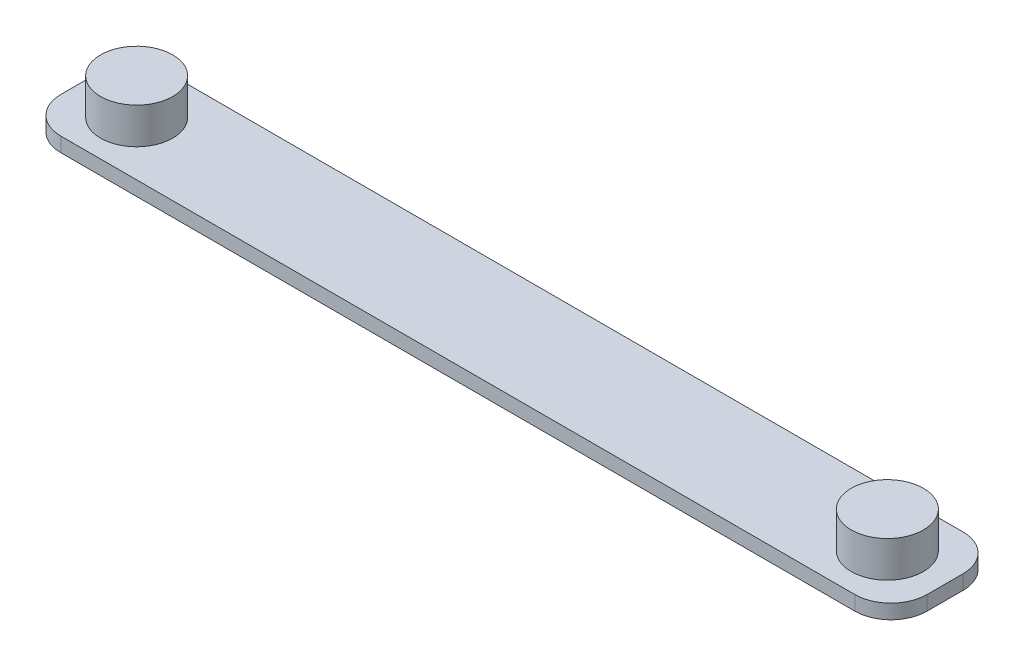
ISO-10303-21;
HEADER;
FILE_DESCRIPTION(('STEP AP214'),'2;1');
FILE_NAME('part.step','',(''),(''),'','','');
FILE_SCHEMA(('AUTOMOTIVE_DESIGN { 1 0 10303 214 1 1 1 1 }'));
ENDSEC;
DATA;
#1=APPLICATION_CONTEXT('core data for automotive mechanical design processes');
#2=APPLICATION_PROTOCOL_DEFINITION('international standard','automotive_design',2000,#1);
#3=PRODUCT_CONTEXT('',#1,'mechanical');
#4=PRODUCT('Part','Part','',(#3));
#5=PRODUCT_RELATED_PRODUCT_CATEGORY('part','',(#4));
#6=PRODUCT_DEFINITION_FORMATION('','',#4);
#7=PRODUCT_DEFINITION_CONTEXT('part definition',#1,'design');
#8=PRODUCT_DEFINITION('design','',#6,#7);
#9=PRODUCT_DEFINITION_SHAPE('','',#8);
#10=(LENGTH_UNIT() NAMED_UNIT(*) SI_UNIT(.MILLI.,.METRE.));
#11=(NAMED_UNIT(*) PLANE_ANGLE_UNIT() SI_UNIT($,.RADIAN.));
#12=(NAMED_UNIT(*) SI_UNIT($,.STERADIAN.) SOLID_ANGLE_UNIT());
#13=UNCERTAINTY_MEASURE_WITH_UNIT(LENGTH_MEASURE(1.E-05),#10,'distance_accuracy_value','');
#14=(GEOMETRIC_REPRESENTATION_CONTEXT(3) GLOBAL_UNCERTAINTY_ASSIGNED_CONTEXT((#13)) GLOBAL_UNIT_ASSIGNED_CONTEXT((#10,
#11,#12)) REPRESENTATION_CONTEXT('',''));
#15=CARTESIAN_POINT('',(0.,0.,0.));
#16=DIRECTION('',(0.,0.,1.));
#17=DIRECTION('',(1.,0.,0.));
#18=AXIS2_PLACEMENT_3D('',#15,#16,#17);
#19=CARTESIAN_POINT('',(-55.,2.,2.5));
#20=DIRECTION('',(0.,-1.,0.));
#21=DIRECTION('',(0.,0.,-1.));
#22=AXIS2_PLACEMENT_3D('',#19,#20,#21);
#23=CYLINDRICAL_SURFACE('',#22,5.);
#24=CARTESIAN_POINT('',(-55.,0.,2.5));
#25=DIRECTION('',(0.,-1.,0.));
#26=DIRECTION('',(0.,0.,-1.));
#27=AXIS2_PLACEMENT_3D('',#24,#25,#26);
#28=CIRCLE('',#27,5.);
#29=CARTESIAN_POINT('',(-55.,0.,7.5));
#30=VERTEX_POINT('',#29);
#31=CARTESIAN_POINT('',(-60.,0.,2.49999999999996));
#32=VERTEX_POINT('',#31);
#33=EDGE_CURVE('E146',#30,#32,#28,.T.);
#34=ORIENTED_EDGE('',*,*,#33,.F.);
#35=DIRECTION('',(0.,-1.,0.));
#36=VECTOR('',#35,1.);
#37=CARTESIAN_POINT('',(-55.,2.,7.5));
#38=LINE('',#37,#36);
#39=CARTESIAN_POINT('',(-55.,2.,7.5));
#40=VERTEX_POINT('',#39);
#41=EDGE_CURVE('E56',#40,#30,#38,.T.);
#42=ORIENTED_EDGE('',*,*,#41,.F.);
#43=CARTESIAN_POINT('',(-55.,2.,2.5));
#44=DIRECTION('',(0.,-1.,0.));
#45=DIRECTION('',(0.,0.,-1.));
#46=AXIS2_PLACEMENT_3D('',#43,#44,#45);
#47=CIRCLE('',#46,5.);
#48=CARTESIAN_POINT('',(-60.,2.,2.49999999999996));
#49=VERTEX_POINT('',#48);
#50=EDGE_CURVE('E174',#40,#49,#47,.T.);
#51=ORIENTED_EDGE('',*,*,#50,.T.);
#52=DIRECTION('',(0.,-1.,0.));
#53=VECTOR('',#52,1.);
#54=CARTESIAN_POINT('',(-60.,2.,2.49999999999996));
#55=LINE('',#54,#53);
#56=EDGE_CURVE('E94',#49,#32,#55,.T.);
#57=ORIENTED_EDGE('',*,*,#56,.T.);
#58=EDGE_LOOP('',(#34,#42,#51,#57));
#59=FACE_BOUND('',#58,.T.);
#60=ADVANCED_FACE('F39',(#59),#23,.T.);
#61=CARTESIAN_POINT('',(-55.,2.,7.5));
#62=DIRECTION('',(0.,0.,-1.));
#63=DIRECTION('',(-1.,0.,0.));
#64=AXIS2_PLACEMENT_3D('',#61,#62,#63);
#65=PLANE('',#64);
#66=DIRECTION('',(1.,0.,0.));
#67=VECTOR('',#66,1.);
#68=CARTESIAN_POINT('',(-55.,0.,7.5));
#69=LINE('',#68,#67);
#70=CARTESIAN_POINT('',(55.,0.,7.5));
#71=VERTEX_POINT('',#70);
#72=EDGE_CURVE('E85',#30,#71,#69,.T.);
#73=ORIENTED_EDGE('',*,*,#72,.T.);
#74=DIRECTION('',(0.,-1.,0.));
#75=VECTOR('',#74,1.);
#76=CARTESIAN_POINT('',(55.,2.,7.5));
#77=LINE('',#76,#75);
#78=CARTESIAN_POINT('',(55.,2.,7.5));
#79=VERTEX_POINT('',#78);
#80=EDGE_CURVE('E131',#79,#71,#77,.T.);
#81=ORIENTED_EDGE('',*,*,#80,.F.);
#82=DIRECTION('',(1.,0.,0.));
#83=VECTOR('',#82,1.);
#84=CARTESIAN_POINT('',(-55.,2.,7.5));
#85=LINE('',#84,#83);
#86=EDGE_CURVE('E118',#40,#79,#85,.T.);
#87=ORIENTED_EDGE('',*,*,#86,.F.);
#88=ORIENTED_EDGE('',*,*,#41,.T.);
#89=EDGE_LOOP('',(#73,#81,#87,#88));
#90=FACE_BOUND('',#89,.T.);
#91=ADVANCED_FACE('F212',(#90),#65,.F.);
#92=CARTESIAN_POINT('',(55.,2.,2.5));
#93=DIRECTION('',(0.,-1.,0.));
#94=DIRECTION('',(0.,0.,-1.));
#95=AXIS2_PLACEMENT_3D('',#92,#93,#94);
#96=CYLINDRICAL_SURFACE('',#95,5.);
#97=CARTESIAN_POINT('',(55.,0.,2.5));
#98=DIRECTION('',(0.,1.,0.));
#99=DIRECTION('',(0.,0.,1.));
#100=AXIS2_PLACEMENT_3D('',#97,#98,#99);
#101=CIRCLE('',#100,5.);
#102=CARTESIAN_POINT('',(60.,0.,2.49999999999996));
#103=VERTEX_POINT('',#102);
#104=EDGE_CURVE('E126',#71,#103,#101,.T.);
#105=ORIENTED_EDGE('',*,*,#104,.T.);
#106=DIRECTION('',(0.,-1.,0.));
#107=VECTOR('',#106,1.);
#108=CARTESIAN_POINT('',(60.,2.,2.49999999999996));
#109=LINE('',#108,#107);
#110=CARTESIAN_POINT('',(60.,2.,2.49999999999996));
#111=VERTEX_POINT('',#110);
#112=EDGE_CURVE('E123',#111,#103,#109,.T.);
#113=ORIENTED_EDGE('',*,*,#112,.F.);
#114=CARTESIAN_POINT('',(55.,2.,2.5));
#115=DIRECTION('',(0.,1.,0.));
#116=DIRECTION('',(0.,0.,1.));
#117=AXIS2_PLACEMENT_3D('',#114,#115,#116);
#118=CIRCLE('',#117,5.);
#119=EDGE_CURVE('E110',#79,#111,#118,.T.);
#120=ORIENTED_EDGE('',*,*,#119,.F.);
#121=ORIENTED_EDGE('',*,*,#80,.T.);
#122=EDGE_LOOP('',(#105,#113,#120,#121));
#123=FACE_BOUND('',#122,.T.);
#124=ADVANCED_FACE('F124',(#123),#96,.T.);
#125=CARTESIAN_POINT('',(60.,2.,2.49999999999996));
#126=DIRECTION('',(-1.,0.,0.));
#127=DIRECTION('',(0.,0.,1.));
#128=AXIS2_PLACEMENT_3D('',#125,#126,#127);
#129=PLANE('',#128);
#130=DIRECTION('',(0.,0.,-1.));
#131=VECTOR('',#130,1.);
#132=CARTESIAN_POINT('',(60.,0.,2.49999999999996));
#133=LINE('',#132,#131);
#134=CARTESIAN_POINT('',(60.,0.,-2.49999999999997));
#135=VERTEX_POINT('',#134);
#136=EDGE_CURVE('E167',#103,#135,#133,.T.);
#137=ORIENTED_EDGE('',*,*,#136,.T.);
#138=DIRECTION('',(0.,-1.,0.));
#139=VECTOR('',#138,1.);
#140=CARTESIAN_POINT('',(60.,2.,-2.49999999999997));
#141=LINE('',#140,#139);
#142=CARTESIAN_POINT('',(60.,2.,-2.49999999999997));
#143=VERTEX_POINT('',#142);
#144=EDGE_CURVE('E132',#143,#135,#141,.T.);
#145=ORIENTED_EDGE('',*,*,#144,.F.);
#146=DIRECTION('',(0.,0.,-1.));
#147=VECTOR('',#146,1.);
#148=CARTESIAN_POINT('',(60.,2.,2.49999999999996));
#149=LINE('',#148,#147);
#150=EDGE_CURVE('E116',#111,#143,#149,.T.);
#151=ORIENTED_EDGE('',*,*,#150,.F.);
#152=ORIENTED_EDGE('',*,*,#112,.T.);
#153=EDGE_LOOP('',(#137,#145,#151,#152));
#154=FACE_BOUND('',#153,.T.);
#155=ADVANCED_FACE('F134',(#154),#129,.F.);
#156=CARTESIAN_POINT('',(55.,2.,-2.5));
#157=DIRECTION('',(0.,-1.,0.));
#158=DIRECTION('',(0.,0.,-1.));
#159=AXIS2_PLACEMENT_3D('',#156,#157,#158);
#160=CYLINDRICAL_SURFACE('',#159,5.);
#161=CARTESIAN_POINT('',(55.,0.,-2.5));
#162=DIRECTION('',(0.,-1.,0.));
#163=DIRECTION('',(0.,0.,-1.));
#164=AXIS2_PLACEMENT_3D('',#161,#162,#163);
#165=CIRCLE('',#164,5.);
#166=CARTESIAN_POINT('',(55.,0.,-7.5));
#167=VERTEX_POINT('',#166);
#168=EDGE_CURVE('E163',#167,#135,#165,.T.);
#169=ORIENTED_EDGE('',*,*,#168,.F.);
#170=DIRECTION('',(0.,-1.,0.));
#171=VECTOR('',#170,1.);
#172=CARTESIAN_POINT('',(55.,2.,-7.5));
#173=LINE('',#172,#171);
#174=CARTESIAN_POINT('',(55.,2.,-7.5));
#175=VERTEX_POINT('',#174);
#176=EDGE_CURVE('E181',#175,#167,#173,.T.);
#177=ORIENTED_EDGE('',*,*,#176,.F.);
#178=CARTESIAN_POINT('',(55.,2.,-2.5));
#179=DIRECTION('',(0.,-1.,0.));
#180=DIRECTION('',(0.,0.,-1.));
#181=AXIS2_PLACEMENT_3D('',#178,#179,#180);
#182=CIRCLE('',#181,5.);
#183=EDGE_CURVE('E137',#175,#143,#182,.T.);
#184=ORIENTED_EDGE('',*,*,#183,.T.);
#185=ORIENTED_EDGE('',*,*,#144,.T.);
#186=EDGE_LOOP('',(#169,#177,#184,#185));
#187=FACE_BOUND('',#186,.T.);
#188=ADVANCED_FACE('F220',(#187),#160,.T.);
#189=CARTESIAN_POINT('',(-55.,2.,-7.5));
#190=DIRECTION('',(0.,0.,-1.));
#191=DIRECTION('',(-1.,0.,0.));
#192=AXIS2_PLACEMENT_3D('',#189,#190,#191);
#193=PLANE('',#192);
#194=DIRECTION('',(1.,0.,0.));
#195=VECTOR('',#194,1.);
#196=CARTESIAN_POINT('',(-55.,0.,-7.5));
#197=LINE('',#196,#195);
#198=CARTESIAN_POINT('',(-55.,0.,-7.5));
#199=VERTEX_POINT('',#198);
#200=EDGE_CURVE('E159',#199,#167,#197,.T.);
#201=ORIENTED_EDGE('',*,*,#200,.F.);
#202=DIRECTION('',(0.,-1.,0.));
#203=VECTOR('',#202,1.);
#204=CARTESIAN_POINT('',(-55.,2.,-7.5));
#205=LINE('',#204,#203);
#206=CARTESIAN_POINT('',(-55.,2.,-7.5));
#207=VERTEX_POINT('',#206);
#208=EDGE_CURVE('E184',#207,#199,#205,.T.);
#209=ORIENTED_EDGE('',*,*,#208,.F.);
#210=DIRECTION('',(1.,0.,0.));
#211=VECTOR('',#210,1.);
#212=CARTESIAN_POINT('',(-55.,2.,-7.5));
#213=LINE('',#212,#211);
#214=EDGE_CURVE('E140',#207,#175,#213,.T.);
#215=ORIENTED_EDGE('',*,*,#214,.T.);
#216=ORIENTED_EDGE('',*,*,#176,.T.);
#217=EDGE_LOOP('',(#201,#209,#215,#216));
#218=FACE_BOUND('',#217,.T.);
#219=ADVANCED_FACE('F226',(#218),#193,.T.);
#220=CARTESIAN_POINT('',(-55.,2.,-2.5));
#221=DIRECTION('',(0.,-1.,0.));
#222=DIRECTION('',(0.,0.,-1.));
#223=AXIS2_PLACEMENT_3D('',#220,#221,#222);
#224=CYLINDRICAL_SURFACE('',#223,5.);
#225=CARTESIAN_POINT('',(-55.,0.,-2.5));
#226=DIRECTION('',(0.,-1.,0.));
#227=DIRECTION('',(0.,0.,-1.));
#228=AXIS2_PLACEMENT_3D('',#225,#226,#227);
#229=CIRCLE('',#228,5.);
#230=CARTESIAN_POINT('',(-60.,0.,-2.49999999999997));
#231=VERTEX_POINT('',#230);
#232=EDGE_CURVE('E155',#231,#199,#229,.T.);
#233=ORIENTED_EDGE('',*,*,#232,.F.);
#234=DIRECTION('',(0.,-1.,0.));
#235=VECTOR('',#234,1.);
#236=CARTESIAN_POINT('',(-60.,2.,-2.49999999999997));
#237=LINE('',#236,#235);
#238=CARTESIAN_POINT('',(-60.,2.,-2.49999999999997));
#239=VERTEX_POINT('',#238);
#240=EDGE_CURVE('E187',#239,#231,#237,.T.);
#241=ORIENTED_EDGE('',*,*,#240,.F.);
#242=CARTESIAN_POINT('',(-55.,2.,-2.5));
#243=DIRECTION('',(0.,-1.,0.));
#244=DIRECTION('',(0.,0.,-1.));
#245=AXIS2_PLACEMENT_3D('',#242,#243,#244);
#246=CIRCLE('',#245,5.);
#247=EDGE_CURVE('E228',#239,#207,#246,.T.);
#248=ORIENTED_EDGE('',*,*,#247,.T.);
#249=ORIENTED_EDGE('',*,*,#208,.T.);
#250=EDGE_LOOP('',(#233,#241,#248,#249));
#251=FACE_BOUND('',#250,.T.);
#252=ADVANCED_FACE('F208',(#251),#224,.T.);
#253=CARTESIAN_POINT('',(-60.,2.,2.49999999999996));
#254=DIRECTION('',(-1.,0.,0.));
#255=DIRECTION('',(0.,0.,1.));
#256=AXIS2_PLACEMENT_3D('',#253,#254,#255);
#257=PLANE('',#256);
#258=DIRECTION('',(0.,0.,-1.));
#259=VECTOR('',#258,1.);
#260=CARTESIAN_POINT('',(-60.,0.,2.49999999999996));
#261=LINE('',#260,#259);
#262=EDGE_CURVE('E150',#32,#231,#261,.T.);
#263=ORIENTED_EDGE('',*,*,#262,.F.);
#264=ORIENTED_EDGE('',*,*,#56,.F.);
#265=DIRECTION('',(0.,0.,-1.));
#266=VECTOR('',#265,1.);
#267=CARTESIAN_POINT('',(-60.,2.,2.49999999999996));
#268=LINE('',#267,#266);
#269=EDGE_CURVE('E230',#49,#239,#268,.T.);
#270=ORIENTED_EDGE('',*,*,#269,.T.);
#271=ORIENTED_EDGE('',*,*,#240,.T.);
#272=EDGE_LOOP('',(#263,#264,#270,#271));
#273=FACE_BOUND('',#272,.T.);
#274=ADVANCED_FACE('F199',(#273),#257,.T.);
#275=CARTESIAN_POINT('',(-55.,2.,2.5));
#276=DIRECTION('',(0.,-1.,0.));
#277=DIRECTION('',(0.,0.,-1.));
#278=AXIS2_PLACEMENT_3D('',#275,#276,#277);
#279=PLANE('',#278);
#280=CARTESIAN_POINT('',(-52.,2.,0.));
#281=DIRECTION('',(0.,-1.,0.));
#282=DIRECTION('',(0.,0.,-1.));
#283=AXIS2_PLACEMENT_3D('',#280,#281,#282);
#284=CIRCLE('',#283,5.);
#285=CARTESIAN_POINT('',(-52.,2.,-5.));
#286=VERTEX_POINT('',#285);
#287=EDGE_CURVE('E11',#286,#286,#284,.F.);
#288=ORIENTED_EDGE('',*,*,#287,.F.);
#289=EDGE_LOOP('',(#288));
#290=FACE_BOUND('',#289,.T.);
#291=CARTESIAN_POINT('',(52.,2.,0.));
#292=DIRECTION('',(0.,-1.,0.));
#293=DIRECTION('',(0.,0.,-1.));
#294=AXIS2_PLACEMENT_3D('',#291,#292,#293);
#295=CIRCLE('',#294,5.);
#296=CARTESIAN_POINT('',(52.,2.,-5.));
#297=VERTEX_POINT('',#296);
#298=EDGE_CURVE('E48',#297,#297,#295,.F.);
#299=ORIENTED_EDGE('',*,*,#298,.F.);
#300=EDGE_LOOP('',(#299));
#301=FACE_BOUND('',#300,.T.);
#302=ORIENTED_EDGE('',*,*,#50,.F.);
#303=ORIENTED_EDGE('',*,*,#86,.T.);
#304=ORIENTED_EDGE('',*,*,#119,.T.);
#305=ORIENTED_EDGE('',*,*,#150,.T.);
#306=ORIENTED_EDGE('',*,*,#183,.F.);
#307=ORIENTED_EDGE('',*,*,#214,.F.);
#308=ORIENTED_EDGE('',*,*,#247,.F.);
#309=ORIENTED_EDGE('',*,*,#269,.F.);
#310=EDGE_LOOP('',(#302,#303,#304,#305,#306,#307,#308,#309));
#311=FACE_BOUND('',#310,.T.);
#312=ADVANCED_FACE('F113',(#290,#301,#311),#279,.F.);
#313=CARTESIAN_POINT('',(-55.,0.,2.5));
#314=DIRECTION('',(0.,-1.,0.));
#315=DIRECTION('',(0.,0.,-1.));
#316=AXIS2_PLACEMENT_3D('',#313,#314,#315);
#317=PLANE('',#316);
#318=ORIENTED_EDGE('',*,*,#33,.T.);
#319=ORIENTED_EDGE('',*,*,#262,.T.);
#320=ORIENTED_EDGE('',*,*,#232,.T.);
#321=ORIENTED_EDGE('',*,*,#200,.T.);
#322=ORIENTED_EDGE('',*,*,#168,.T.);
#323=ORIENTED_EDGE('',*,*,#136,.F.);
#324=ORIENTED_EDGE('',*,*,#104,.F.);
#325=ORIENTED_EDGE('',*,*,#72,.F.);
#326=EDGE_LOOP('',(#318,#319,#320,#321,#322,#323,#324,#325));
#327=FACE_BOUND('',#326,.T.);
#328=ADVANCED_FACE('F198',(#327),#317,.T.);
#329=CARTESIAN_POINT('',(52.,7.,0.));
#330=DIRECTION('',(0.,-1.,0.));
#331=DIRECTION('',(0.,0.,-1.));
#332=AXIS2_PLACEMENT_3D('',#329,#330,#331);
#333=CYLINDRICAL_SURFACE('',#332,5.);
#334=CARTESIAN_POINT('',(52.,7.,0.));
#335=DIRECTION('',(0.,1.,0.));
#336=DIRECTION('',(0.,0.,1.));
#337=AXIS2_PLACEMENT_3D('',#334,#335,#336);
#338=CIRCLE('',#337,5.);
#339=CARTESIAN_POINT('',(52.,7.,5.));
#340=VERTEX_POINT('',#339);
#341=EDGE_CURVE('E151',#340,#340,#338,.T.);
#342=ORIENTED_EDGE('',*,*,#341,.F.);
#343=EDGE_LOOP('',(#342));
#344=FACE_BOUND('',#343,.T.);
#345=ORIENTED_EDGE('',*,*,#298,.T.);
#346=EDGE_LOOP('',(#345));
#347=FACE_BOUND('',#346,.T.);
#348=ADVANCED_FACE('F195',(#344,#347),#333,.T.);
#349=CARTESIAN_POINT('',(52.,7.,0.));
#350=DIRECTION('',(0.,1.,0.));
#351=DIRECTION('',(0.,0.,1.));
#352=AXIS2_PLACEMENT_3D('',#349,#350,#351);
#353=PLANE('',#352);
#354=ORIENTED_EDGE('',*,*,#341,.T.);
#355=EDGE_LOOP('',(#354));
#356=FACE_BOUND('',#355,.T.);
#357=ADVANCED_FACE('F250',(#356),#353,.T.);
#358=CARTESIAN_POINT('',(-52.,7.,0.));
#359=DIRECTION('',(0.,-1.,0.));
#360=DIRECTION('',(0.,0.,-1.));
#361=AXIS2_PLACEMENT_3D('',#358,#359,#360);
#362=CYLINDRICAL_SURFACE('',#361,5.);
#363=CARTESIAN_POINT('',(-52.,7.,0.));
#364=DIRECTION('',(0.,1.,0.));
#365=DIRECTION('',(0.,0.,-1.));
#366=AXIS2_PLACEMENT_3D('',#363,#364,#365);
#367=CIRCLE('',#366,5.);
#368=CARTESIAN_POINT('',(-52.,7.,-5.));
#369=VERTEX_POINT('',#368);
#370=EDGE_CURVE('E240',#369,#369,#367,.T.);
#371=ORIENTED_EDGE('',*,*,#370,.F.);
#372=EDGE_LOOP('',(#371));
#373=FACE_BOUND('',#372,.T.);
#374=ORIENTED_EDGE('',*,*,#287,.T.);
#375=EDGE_LOOP('',(#374));
#376=FACE_BOUND('',#375,.T.);
#377=ADVANCED_FACE('F247',(#373,#376),#362,.T.);
#378=CARTESIAN_POINT('',(-52.,7.,0.));
#379=DIRECTION('',(0.,-1.,0.));
#380=DIRECTION('',(0.,0.,-1.));
#381=AXIS2_PLACEMENT_3D('',#378,#379,#380);
#382=PLANE('',#381);
#383=ORIENTED_EDGE('',*,*,#370,.T.);
#384=EDGE_LOOP('',(#383));
#385=FACE_BOUND('',#384,.T.);
#386=ADVANCED_FACE('F245',(#385),#382,.F.);
#387=CLOSED_SHELL('',(#60,#91,#124,#155,#188,#219,#252,#274,#312,#328,#348,#357,#377,#386));
#388=MANIFOLD_SOLID_BREP('B2',#387);
#389=ADVANCED_BREP_SHAPE_REPRESENTATION('',(#18,#388),#14);
#390=SHAPE_DEFINITION_REPRESENTATION(#9,#389);
ENDSEC;
END-ISO-10303-21;
